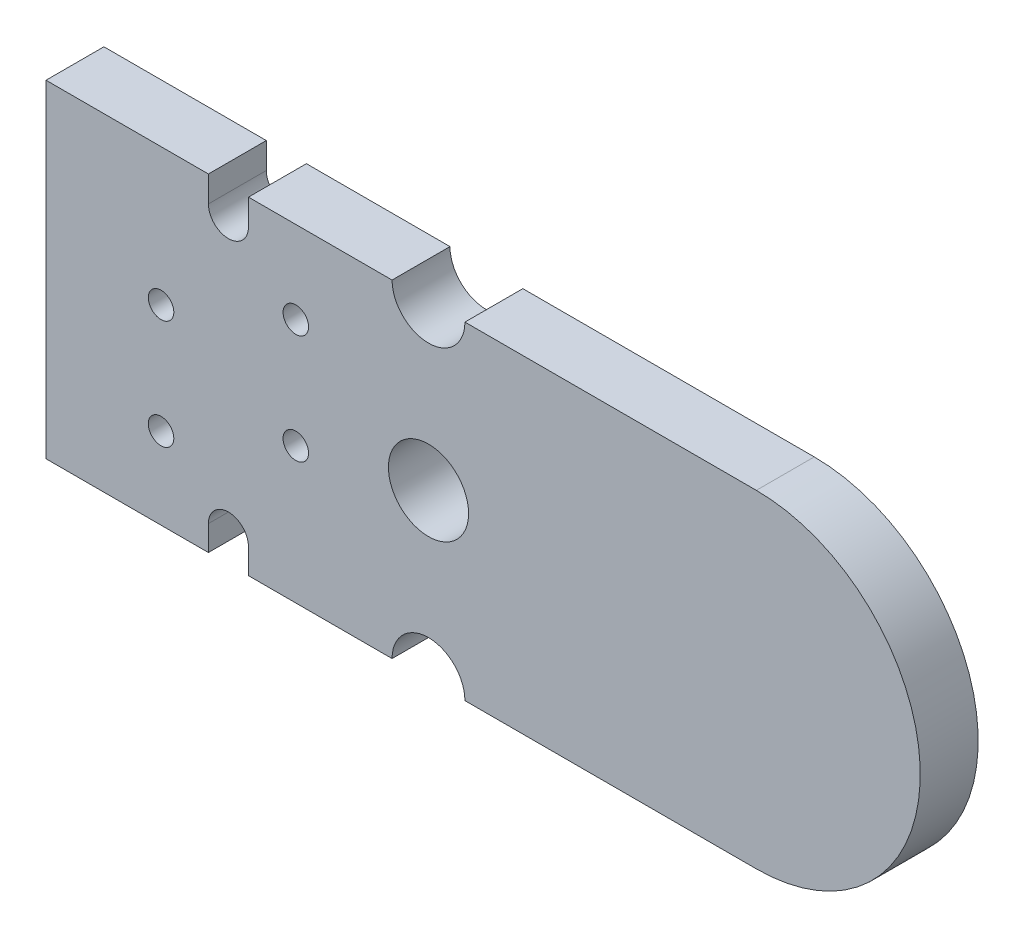
ISO-10303-21;
HEADER;
FILE_DESCRIPTION(('STEP AP214'),'2;1');
FILE_NAME('part.step','',(''),(''),'','','');
FILE_SCHEMA(('AUTOMOTIVE_DESIGN { 1 0 10303 214 1 1 1 1 }'));
ENDSEC;
DATA;
#1=APPLICATION_CONTEXT('core data for automotive mechanical design processes');
#2=APPLICATION_PROTOCOL_DEFINITION('international standard','automotive_design',2000,#1);
#3=PRODUCT_CONTEXT('',#1,'mechanical');
#4=PRODUCT('Part','Part','',(#3));
#5=PRODUCT_RELATED_PRODUCT_CATEGORY('part','',(#4));
#6=PRODUCT_DEFINITION_FORMATION('','',#4);
#7=PRODUCT_DEFINITION_CONTEXT('part definition',#1,'design');
#8=PRODUCT_DEFINITION('design','',#6,#7);
#9=PRODUCT_DEFINITION_SHAPE('','',#8);
#10=(LENGTH_UNIT() NAMED_UNIT(*) SI_UNIT(.MILLI.,.METRE.));
#11=(NAMED_UNIT(*) PLANE_ANGLE_UNIT() SI_UNIT($,.RADIAN.));
#12=(NAMED_UNIT(*) SI_UNIT($,.STERADIAN.) SOLID_ANGLE_UNIT());
#13=UNCERTAINTY_MEASURE_WITH_UNIT(LENGTH_MEASURE(1.E-05),#10,'distance_accuracy_value','');
#14=(GEOMETRIC_REPRESENTATION_CONTEXT(3) GLOBAL_UNCERTAINTY_ASSIGNED_CONTEXT((#13)) GLOBAL_UNIT_ASSIGNED_CONTEXT((#10,
#11,#12)) REPRESENTATION_CONTEXT('',''));
#15=CARTESIAN_POINT('',(0.,0.,0.));
#16=DIRECTION('',(0.,0.,1.));
#17=DIRECTION('',(1.,0.,0.));
#18=AXIS2_PLACEMENT_3D('',#15,#16,#17);
#19=CARTESIAN_POINT('',(28.00799,93.788,1.59));
#20=DIRECTION('',(0.,0.,-1.));
#21=DIRECTION('',(-1.,0.,0.));
#22=AXIS2_PLACEMENT_3D('',#19,#20,#21);
#23=CYLINDRICAL_SURFACE('',#22,0.550000000000002);
#24=CARTESIAN_POINT('',(28.00799,93.788,0.));
#25=DIRECTION('',(0.,0.,-1.));
#26=DIRECTION('',(-1.,0.,0.));
#27=AXIS2_PLACEMENT_3D('',#24,#25,#26);
#28=CIRCLE('',#27,0.550000000000002);
#29=CARTESIAN_POINT('',(28.55799,93.788,0.));
#30=VERTEX_POINT('',#29);
#31=CARTESIAN_POINT('',(27.45799,93.788,0.));
#32=VERTEX_POINT('',#31);
#33=EDGE_CURVE('E181',#30,#32,#28,.T.);
#34=ORIENTED_EDGE('',*,*,#33,.T.);
#35=DIRECTION('',(0.,0.,-1.));
#36=VECTOR('',#35,1.);
#37=CARTESIAN_POINT('',(27.45799,93.788,1.59));
#38=LINE('',#37,#36);
#39=CARTESIAN_POINT('',(27.45799,93.788,1.59));
#40=VERTEX_POINT('',#39);
#41=EDGE_CURVE('E11',#40,#32,#38,.T.);
#42=ORIENTED_EDGE('',*,*,#41,.F.);
#43=CARTESIAN_POINT('',(28.00799,93.788,1.59));
#44=DIRECTION('',(0.,0.,-1.));
#45=DIRECTION('',(-1.,0.,0.));
#46=AXIS2_PLACEMENT_3D('',#43,#44,#45);
#47=CIRCLE('',#46,0.550000000000002);
#48=CARTESIAN_POINT('',(28.55799,93.788,1.59));
#49=VERTEX_POINT('',#48);
#50=EDGE_CURVE('E212',#49,#40,#47,.T.);
#51=ORIENTED_EDGE('',*,*,#50,.F.);
#52=DIRECTION('',(0.,0.,-1.));
#53=VECTOR('',#52,1.);
#54=CARTESIAN_POINT('',(28.55799,93.788,1.59));
#55=LINE('',#54,#53);
#56=EDGE_CURVE('E177',#49,#30,#55,.T.);
#57=ORIENTED_EDGE('',*,*,#56,.T.);
#58=EDGE_LOOP('',(#34,#42,#51,#57));
#59=FACE_BOUND('',#58,.T.);
#60=ADVANCED_FACE('F37',(#59),#23,.F.);
#61=CARTESIAN_POINT('',(27.45799,93.788,1.59));
#62=DIRECTION('',(-1.,0.,0.));
#63=DIRECTION('',(0.,0.,1.));
#64=AXIS2_PLACEMENT_3D('',#61,#62,#63);
#65=PLANE('',#64);
#66=DIRECTION('',(0.,1.,0.));
#67=VECTOR('',#66,1.);
#68=CARTESIAN_POINT('',(27.45799,93.788,0.));
#69=LINE('',#68,#67);
#70=CARTESIAN_POINT('',(27.45799,94.5,0.));
#71=VERTEX_POINT('',#70);
#72=EDGE_CURVE('E184',#32,#71,#69,.T.);
#73=ORIENTED_EDGE('',*,*,#72,.T.);
#74=DIRECTION('',(0.,0.,-1.));
#75=VECTOR('',#74,1.);
#76=CARTESIAN_POINT('',(27.45799,94.5,1.59));
#77=LINE('',#76,#75);
#78=CARTESIAN_POINT('',(27.45799,94.5,1.59));
#79=VERTEX_POINT('',#78);
#80=EDGE_CURVE('E45',#79,#71,#77,.T.);
#81=ORIENTED_EDGE('',*,*,#80,.F.);
#82=DIRECTION('',(0.,1.,0.));
#83=VECTOR('',#82,1.);
#84=CARTESIAN_POINT('',(27.45799,93.788,1.59));
#85=LINE('',#84,#83);
#86=EDGE_CURVE('E120',#40,#79,#85,.T.);
#87=ORIENTED_EDGE('',*,*,#86,.F.);
#88=ORIENTED_EDGE('',*,*,#41,.T.);
#89=EDGE_LOOP('',(#73,#81,#87,#88));
#90=FACE_BOUND('',#89,.T.);
#91=ADVANCED_FACE('F312',(#90),#65,.F.);
#92=CARTESIAN_POINT('',(27.45799,94.5,1.59));
#93=DIRECTION('',(0.,-1.,0.));
#94=DIRECTION('',(0.,0.,-1.));
#95=AXIS2_PLACEMENT_3D('',#92,#93,#94);
#96=PLANE('',#95);
#97=DIRECTION('',(-1.,0.,0.));
#98=VECTOR('',#97,1.);
#99=CARTESIAN_POINT('',(27.45799,94.5,0.));
#100=LINE('',#99,#98);
#101=CARTESIAN_POINT('',(22.99997,94.5,0.));
#102=VERTEX_POINT('',#101);
#103=EDGE_CURVE('E187',#71,#102,#100,.T.);
#104=ORIENTED_EDGE('',*,*,#103,.T.);
#105=DIRECTION('',(0.,0.,-1.));
#106=VECTOR('',#105,1.);
#107=CARTESIAN_POINT('',(22.99997,94.5,1.59));
#108=LINE('',#107,#106);
#109=CARTESIAN_POINT('',(22.99997,94.5,1.59));
#110=VERTEX_POINT('',#109);
#111=EDGE_CURVE('E243',#110,#102,#108,.T.);
#112=ORIENTED_EDGE('',*,*,#111,.F.);
#113=DIRECTION('',(-1.,0.,0.));
#114=VECTOR('',#113,1.);
#115=CARTESIAN_POINT('',(27.45799,94.5,1.59));
#116=LINE('',#115,#114);
#117=EDGE_CURVE('E251',#79,#110,#116,.T.);
#118=ORIENTED_EDGE('',*,*,#117,.F.);
#119=ORIENTED_EDGE('',*,*,#80,.T.);
#120=EDGE_LOOP('',(#104,#112,#118,#119));
#121=FACE_BOUND('',#120,.T.);
#122=ADVANCED_FACE('F249',(#121),#96,.F.);
#123=CARTESIAN_POINT('',(22.99997,94.5,1.59));
#124=DIRECTION('',(1.,0.,0.));
#125=DIRECTION('',(0.,0.,-1.));
#126=AXIS2_PLACEMENT_3D('',#123,#124,#125);
#127=PLANE('',#126);
#128=DIRECTION('',(0.,-1.,0.));
#129=VECTOR('',#128,1.);
#130=CARTESIAN_POINT('',(22.99997,94.5,0.));
#131=LINE('',#130,#129);
#132=CARTESIAN_POINT('',(22.99997,85.5,0.));
#133=VERTEX_POINT('',#132);
#134=EDGE_CURVE('E189',#102,#133,#131,.T.);
#135=ORIENTED_EDGE('',*,*,#134,.T.);
#136=DIRECTION('',(0.,0.,-1.));
#137=VECTOR('',#136,1.);
#138=CARTESIAN_POINT('',(22.99997,85.5,1.59));
#139=LINE('',#138,#137);
#140=CARTESIAN_POINT('',(22.99997,85.5,1.59));
#141=VERTEX_POINT('',#140);
#142=EDGE_CURVE('E240',#141,#133,#139,.T.);
#143=ORIENTED_EDGE('',*,*,#142,.F.);
#144=DIRECTION('',(0.,-1.,0.));
#145=VECTOR('',#144,1.);
#146=CARTESIAN_POINT('',(22.99997,94.5,1.59));
#147=LINE('',#146,#145);
#148=EDGE_CURVE('E269',#110,#141,#147,.T.);
#149=ORIENTED_EDGE('',*,*,#148,.F.);
#150=ORIENTED_EDGE('',*,*,#111,.T.);
#151=EDGE_LOOP('',(#135,#143,#149,#150));
#152=FACE_BOUND('',#151,.T.);
#153=ADVANCED_FACE('F260',(#152),#127,.F.);
#154=CARTESIAN_POINT('',(22.99997,85.5,1.59));
#155=DIRECTION('',(4.48629661083333E-06,0.999999999989937,0.));
#156=DIRECTION('',(-0.999999999989937,4.48629661083333E-06,0.));
#157=AXIS2_PLACEMENT_3D('',#154,#155,#156);
#158=PLANE('',#157);
#159=DIRECTION('',(0.999999999989937,-4.48629661083333E-06,0.));
#160=VECTOR('',#159,1.);
#161=CARTESIAN_POINT('',(22.99997,85.5,0.));
#162=LINE('',#161,#160);
#163=CARTESIAN_POINT('',(27.45799,85.49998,0.));
#164=VERTEX_POINT('',#163);
#165=EDGE_CURVE('E191',#133,#164,#162,.T.);
#166=ORIENTED_EDGE('',*,*,#165,.T.);
#167=DIRECTION('',(0.,0.,-1.));
#168=VECTOR('',#167,1.);
#169=CARTESIAN_POINT('',(27.45799,85.49998,1.59));
#170=LINE('',#169,#168);
#171=CARTESIAN_POINT('',(27.45799,85.49998,1.59));
#172=VERTEX_POINT('',#171);
#173=EDGE_CURVE('E237',#172,#164,#170,.T.);
#174=ORIENTED_EDGE('',*,*,#173,.F.);
#175=DIRECTION('',(0.999999999989937,-4.48629661083333E-06,0.));
#176=VECTOR('',#175,1.);
#177=CARTESIAN_POINT('',(22.99997,85.5,1.59));
#178=LINE('',#177,#176);
#179=EDGE_CURVE('E266',#141,#172,#178,.T.);
#180=ORIENTED_EDGE('',*,*,#179,.F.);
#181=ORIENTED_EDGE('',*,*,#142,.T.);
#182=EDGE_LOOP('',(#166,#174,#180,#181));
#183=FACE_BOUND('',#182,.T.);
#184=ADVANCED_FACE('F264',(#183),#158,.F.);
#185=CARTESIAN_POINT('',(27.45799,85.49998,1.59));
#186=DIRECTION('',(-1.,0.,0.));
#187=DIRECTION('',(0.,0.,1.));
#188=AXIS2_PLACEMENT_3D('',#185,#186,#187);
#189=PLANE('',#188);
#190=DIRECTION('',(0.,1.,0.));
#191=VECTOR('',#190,1.);
#192=CARTESIAN_POINT('',(27.45799,85.49998,0.));
#193=LINE('',#192,#191);
#194=CARTESIAN_POINT('',(27.45799,86.18801,0.));
#195=VERTEX_POINT('',#194);
#196=EDGE_CURVE('E193',#164,#195,#193,.T.);
#197=ORIENTED_EDGE('',*,*,#196,.T.);
#198=DIRECTION('',(0.,0.,-1.));
#199=VECTOR('',#198,1.);
#200=CARTESIAN_POINT('',(27.45799,86.18801,1.59));
#201=LINE('',#200,#199);
#202=CARTESIAN_POINT('',(27.45799,86.18801,1.59));
#203=VERTEX_POINT('',#202);
#204=EDGE_CURVE('E234',#203,#195,#201,.T.);
#205=ORIENTED_EDGE('',*,*,#204,.F.);
#206=DIRECTION('',(0.,1.,0.));
#207=VECTOR('',#206,1.);
#208=CARTESIAN_POINT('',(27.45799,85.49998,1.59));
#209=LINE('',#208,#207);
#210=EDGE_CURVE('E268',#172,#203,#209,.T.);
#211=ORIENTED_EDGE('',*,*,#210,.F.);
#212=ORIENTED_EDGE('',*,*,#173,.T.);
#213=EDGE_LOOP('',(#197,#205,#211,#212));
#214=FACE_BOUND('',#213,.T.);
#215=ADVANCED_FACE('F325',(#214),#189,.F.);
#216=CARTESIAN_POINT('',(28.00799,86.18801,1.59));
#217=DIRECTION('',(0.,0.,-1.));
#218=DIRECTION('',(-1.,0.,0.));
#219=AXIS2_PLACEMENT_3D('',#216,#217,#218);
#220=CYLINDRICAL_SURFACE('',#219,0.550000000000002);
#221=CARTESIAN_POINT('',(28.00799,86.18801,0.));
#222=DIRECTION('',(0.,0.,-1.));
#223=DIRECTION('',(-1.,0.,0.));
#224=AXIS2_PLACEMENT_3D('',#221,#222,#223);
#225=CIRCLE('',#224,0.550000000000002);
#226=CARTESIAN_POINT('',(28.55799,86.18801,0.));
#227=VERTEX_POINT('',#226);
#228=EDGE_CURVE('E195',#195,#227,#225,.T.);
#229=ORIENTED_EDGE('',*,*,#228,.T.);
#230=DIRECTION('',(0.,0.,-1.));
#231=VECTOR('',#230,1.);
#232=CARTESIAN_POINT('',(28.55799,86.18801,1.59));
#233=LINE('',#232,#231);
#234=CARTESIAN_POINT('',(28.55799,86.18801,1.59));
#235=VERTEX_POINT('',#234);
#236=EDGE_CURVE('E231',#235,#227,#233,.T.);
#237=ORIENTED_EDGE('',*,*,#236,.F.);
#238=CARTESIAN_POINT('',(28.00799,86.18801,1.59));
#239=DIRECTION('',(0.,0.,-1.));
#240=DIRECTION('',(-1.,0.,0.));
#241=AXIS2_PLACEMENT_3D('',#238,#239,#240);
#242=CIRCLE('',#241,0.550000000000002);
#243=EDGE_CURVE('E271',#203,#235,#242,.T.);
#244=ORIENTED_EDGE('',*,*,#243,.F.);
#245=ORIENTED_EDGE('',*,*,#204,.T.);
#246=EDGE_LOOP('',(#229,#237,#244,#245));
#247=FACE_BOUND('',#246,.T.);
#248=ADVANCED_FACE('F328',(#247),#220,.F.);
#249=CARTESIAN_POINT('',(28.55799,86.18801,1.59));
#250=DIRECTION('',(1.,0.,0.));
#251=DIRECTION('',(0.,0.,-1.));
#252=AXIS2_PLACEMENT_3D('',#249,#250,#251);
#253=PLANE('',#252);
#254=DIRECTION('',(0.,-1.,0.));
#255=VECTOR('',#254,1.);
#256=CARTESIAN_POINT('',(28.55799,86.18801,0.));
#257=LINE('',#256,#255);
#258=CARTESIAN_POINT('',(28.55799,85.49998,0.));
#259=VERTEX_POINT('',#258);
#260=EDGE_CURVE('E197',#227,#259,#257,.T.);
#261=ORIENTED_EDGE('',*,*,#260,.T.);
#262=DIRECTION('',(0.,0.,-1.));
#263=VECTOR('',#262,1.);
#264=CARTESIAN_POINT('',(28.55799,85.49998,1.59));
#265=LINE('',#264,#263);
#266=CARTESIAN_POINT('',(28.55799,85.49998,1.59));
#267=VERTEX_POINT('',#266);
#268=EDGE_CURVE('E228',#267,#259,#265,.T.);
#269=ORIENTED_EDGE('',*,*,#268,.F.);
#270=DIRECTION('',(0.,-1.,0.));
#271=VECTOR('',#270,1.);
#272=CARTESIAN_POINT('',(28.55799,86.18801,1.59));
#273=LINE('',#272,#271);
#274=EDGE_CURVE('E277',#235,#267,#273,.T.);
#275=ORIENTED_EDGE('',*,*,#274,.F.);
#276=ORIENTED_EDGE('',*,*,#236,.T.);
#277=EDGE_LOOP('',(#261,#269,#275,#276));
#278=FACE_BOUND('',#277,.T.);
#279=ADVANCED_FACE('F332',(#278),#253,.F.);
#280=CARTESIAN_POINT('',(28.55799,85.49998,1.59));
#281=DIRECTION('',(0.,1.,0.));
#282=DIRECTION('',(0.,0.,1.));
#283=AXIS2_PLACEMENT_3D('',#280,#281,#282);
#284=PLANE('',#283);
#285=DIRECTION('',(1.,0.,0.));
#286=VECTOR('',#285,1.);
#287=CARTESIAN_POINT('',(28.55799,85.49998,0.));
#288=LINE('',#287,#286);
#289=CARTESIAN_POINT('',(32.49999,85.49998,0.));
#290=VERTEX_POINT('',#289);
#291=EDGE_CURVE('E199',#259,#290,#288,.T.);
#292=ORIENTED_EDGE('',*,*,#291,.T.);
#293=DIRECTION('',(0.,0.,-1.));
#294=VECTOR('',#293,1.);
#295=CARTESIAN_POINT('',(32.49999,85.49998,1.59));
#296=LINE('',#295,#294);
#297=CARTESIAN_POINT('',(32.49999,85.49998,1.59));
#298=VERTEX_POINT('',#297);
#299=EDGE_CURVE('E225',#298,#290,#296,.T.);
#300=ORIENTED_EDGE('',*,*,#299,.F.);
#301=DIRECTION('',(1.,0.,0.));
#302=VECTOR('',#301,1.);
#303=CARTESIAN_POINT('',(28.55799,85.49998,1.59));
#304=LINE('',#303,#302);
#305=EDGE_CURVE('E279',#267,#298,#304,.T.);
#306=ORIENTED_EDGE('',*,*,#305,.F.);
#307=ORIENTED_EDGE('',*,*,#268,.T.);
#308=EDGE_LOOP('',(#292,#300,#306,#307));
#309=FACE_BOUND('',#308,.T.);
#310=ADVANCED_FACE('F336',(#309),#284,.F.);
#311=CARTESIAN_POINT('',(33.49998,85.49999,1.59));
#312=DIRECTION('',(0.,0.,-1.));
#313=DIRECTION('',(-1.,0.,0.));
#314=AXIS2_PLACEMENT_3D('',#311,#312,#313);
#315=CYLINDRICAL_SURFACE('',#314,0.99999000005);
#316=CARTESIAN_POINT('',(33.49998,85.49999,0.));
#317=DIRECTION('',(0.,0.,-1.));
#318=DIRECTION('',(-1.,0.,0.));
#319=AXIS2_PLACEMENT_3D('',#316,#317,#318);
#320=CIRCLE('',#319,0.99999000005);
#321=CARTESIAN_POINT('',(34.49997,85.5,0.));
#322=VERTEX_POINT('',#321);
#323=EDGE_CURVE('E201',#290,#322,#320,.T.);
#324=ORIENTED_EDGE('',*,*,#323,.T.);
#325=DIRECTION('',(0.,0.,-1.));
#326=VECTOR('',#325,1.);
#327=CARTESIAN_POINT('',(34.49997,85.5,1.59));
#328=LINE('',#327,#326);
#329=CARTESIAN_POINT('',(34.49997,85.5,1.59));
#330=VERTEX_POINT('',#329);
#331=EDGE_CURVE('E222',#330,#322,#328,.T.);
#332=ORIENTED_EDGE('',*,*,#331,.F.);
#333=CARTESIAN_POINT('',(33.49998,85.49999,1.59));
#334=DIRECTION('',(0.,0.,-1.));
#335=DIRECTION('',(-1.,0.,0.));
#336=AXIS2_PLACEMENT_3D('',#333,#334,#335);
#337=CIRCLE('',#336,0.99999000005);
#338=EDGE_CURVE('E281',#298,#330,#337,.T.);
#339=ORIENTED_EDGE('',*,*,#338,.F.);
#340=ORIENTED_EDGE('',*,*,#299,.T.);
#341=EDGE_LOOP('',(#324,#332,#339,#340));
#342=FACE_BOUND('',#341,.T.);
#343=ADVANCED_FACE('F340',(#342),#315,.F.);
#344=CARTESIAN_POINT('',(34.49997,85.5,1.59));
#345=DIRECTION('',(0.,1.,0.));
#346=DIRECTION('',(0.,0.,1.));
#347=AXIS2_PLACEMENT_3D('',#344,#345,#346);
#348=PLANE('',#347);
#349=DIRECTION('',(1.,0.,0.));
#350=VECTOR('',#349,1.);
#351=CARTESIAN_POINT('',(34.49997,85.5,0.));
#352=LINE('',#351,#350);
#353=CARTESIAN_POINT('',(42.49997,85.5,0.));
#354=VERTEX_POINT('',#353);
#355=EDGE_CURVE('E203',#322,#354,#352,.T.);
#356=ORIENTED_EDGE('',*,*,#355,.T.);
#357=DIRECTION('',(0.,0.,-1.));
#358=VECTOR('',#357,1.);
#359=CARTESIAN_POINT('',(42.49997,85.5,1.59));
#360=LINE('',#359,#358);
#361=CARTESIAN_POINT('',(42.49997,85.5,1.59));
#362=VERTEX_POINT('',#361);
#363=EDGE_CURVE('E219',#362,#354,#360,.T.);
#364=ORIENTED_EDGE('',*,*,#363,.F.);
#365=DIRECTION('',(1.,0.,0.));
#366=VECTOR('',#365,1.);
#367=CARTESIAN_POINT('',(34.49997,85.5,1.59));
#368=LINE('',#367,#366);
#369=EDGE_CURVE('E283',#330,#362,#368,.T.);
#370=ORIENTED_EDGE('',*,*,#369,.F.);
#371=ORIENTED_EDGE('',*,*,#331,.T.);
#372=EDGE_LOOP('',(#356,#364,#370,#371));
#373=FACE_BOUND('',#372,.T.);
#374=ADVANCED_FACE('F344',(#373),#348,.F.);
#375=CARTESIAN_POINT('',(42.4999701774114,90.,1.59));
#376=DIRECTION('',(0.,0.,-1.));
#377=DIRECTION('',(-1.,0.,0.));
#378=AXIS2_PLACEMENT_3D('',#375,#376,#377);
#379=CYLINDRICAL_SURFACE('',#378,4.5);
#380=CARTESIAN_POINT('',(42.4999701774114,90.,0.));
#381=DIRECTION('',(0.,0.,1.));
#382=DIRECTION('',(1.,0.,0.));
#383=AXIS2_PLACEMENT_3D('',#380,#381,#382);
#384=CIRCLE('',#383,4.5);
#385=CARTESIAN_POINT('',(42.49997,94.5,0.));
#386=VERTEX_POINT('',#385);
#387=EDGE_CURVE('E205',#354,#386,#384,.T.);
#388=ORIENTED_EDGE('',*,*,#387,.T.);
#389=DIRECTION('',(0.,0.,-1.));
#390=VECTOR('',#389,1.);
#391=CARTESIAN_POINT('',(42.49997,94.5,1.59));
#392=LINE('',#391,#390);
#393=CARTESIAN_POINT('',(42.49997,94.5,1.59));
#394=VERTEX_POINT('',#393);
#395=EDGE_CURVE('E216',#394,#386,#392,.T.);
#396=ORIENTED_EDGE('',*,*,#395,.F.);
#397=CARTESIAN_POINT('',(42.4999701774114,90.,1.59));
#398=DIRECTION('',(0.,0.,1.));
#399=DIRECTION('',(1.,0.,0.));
#400=AXIS2_PLACEMENT_3D('',#397,#398,#399);
#401=CIRCLE('',#400,4.5);
#402=EDGE_CURVE('E285',#362,#394,#401,.T.);
#403=ORIENTED_EDGE('',*,*,#402,.F.);
#404=ORIENTED_EDGE('',*,*,#363,.T.);
#405=EDGE_LOOP('',(#388,#396,#403,#404));
#406=FACE_BOUND('',#405,.T.);
#407=ADVANCED_FACE('F291',(#406),#379,.T.);
#408=CARTESIAN_POINT('',(42.49997,94.5,1.59));
#409=DIRECTION('',(0.,-1.,0.));
#410=DIRECTION('',(0.,0.,-1.));
#411=AXIS2_PLACEMENT_3D('',#408,#409,#410);
#412=PLANE('',#411);
#413=DIRECTION('',(-1.,0.,0.));
#414=VECTOR('',#413,1.);
#415=CARTESIAN_POINT('',(42.49997,94.5,0.));
#416=LINE('',#415,#414);
#417=CARTESIAN_POINT('',(34.49997,94.5,0.));
#418=VERTEX_POINT('',#417);
#419=EDGE_CURVE('E207',#386,#418,#416,.T.);
#420=ORIENTED_EDGE('',*,*,#419,.T.);
#421=DIRECTION('',(0.,0.,-1.));
#422=VECTOR('',#421,1.);
#423=CARTESIAN_POINT('',(34.49997,94.5,1.59));
#424=LINE('',#423,#422);
#425=CARTESIAN_POINT('',(34.49997,94.5,1.59));
#426=VERTEX_POINT('',#425);
#427=EDGE_CURVE('E172',#426,#418,#424,.T.);
#428=ORIENTED_EDGE('',*,*,#427,.F.);
#429=DIRECTION('',(-1.,0.,0.));
#430=VECTOR('',#429,1.);
#431=CARTESIAN_POINT('',(42.49997,94.5,1.59));
#432=LINE('',#431,#430);
#433=EDGE_CURVE('E163',#394,#426,#432,.T.);
#434=ORIENTED_EDGE('',*,*,#433,.F.);
#435=ORIENTED_EDGE('',*,*,#395,.T.);
#436=EDGE_LOOP('',(#420,#428,#434,#435));
#437=FACE_BOUND('',#436,.T.);
#438=ADVANCED_FACE('F295',(#437),#412,.F.);
#439=CARTESIAN_POINT('',(33.49997,94.5,1.59));
#440=DIRECTION('',(0.,0.,-1.));
#441=DIRECTION('',(-1.,0.,0.));
#442=AXIS2_PLACEMENT_3D('',#439,#440,#441);
#443=CYLINDRICAL_SURFACE('',#442,1.);
#444=CARTESIAN_POINT('',(33.49997,94.5,0.));
#445=DIRECTION('',(0.,0.,-1.));
#446=DIRECTION('',(-1.,0.,0.));
#447=AXIS2_PLACEMENT_3D('',#444,#445,#446);
#448=CIRCLE('',#447,1.);
#449=CARTESIAN_POINT('',(32.49997,94.5,0.));
#450=VERTEX_POINT('',#449);
#451=EDGE_CURVE('E171',#418,#450,#448,.T.);
#452=ORIENTED_EDGE('',*,*,#451,.T.);
#453=DIRECTION('',(0.,0.,-1.));
#454=VECTOR('',#453,1.);
#455=CARTESIAN_POINT('',(32.49997,94.5,1.59));
#456=LINE('',#455,#454);
#457=CARTESIAN_POINT('',(32.49997,94.5,1.59));
#458=VERTEX_POINT('',#457);
#459=EDGE_CURVE('E168',#458,#450,#456,.T.);
#460=ORIENTED_EDGE('',*,*,#459,.F.);
#461=CARTESIAN_POINT('',(33.49997,94.5,1.59));
#462=DIRECTION('',(0.,0.,-1.));
#463=DIRECTION('',(-1.,0.,0.));
#464=AXIS2_PLACEMENT_3D('',#461,#462,#463);
#465=CIRCLE('',#464,1.);
#466=EDGE_CURVE('E157',#426,#458,#465,.T.);
#467=ORIENTED_EDGE('',*,*,#466,.F.);
#468=ORIENTED_EDGE('',*,*,#427,.T.);
#469=EDGE_LOOP('',(#452,#460,#467,#468));
#470=FACE_BOUND('',#469,.T.);
#471=ADVANCED_FACE('F169',(#470),#443,.F.);
#472=CARTESIAN_POINT('',(32.49997,94.5,1.59));
#473=DIRECTION('',(0.,-1.,0.));
#474=DIRECTION('',(0.,0.,-1.));
#475=AXIS2_PLACEMENT_3D('',#472,#473,#474);
#476=PLANE('',#475);
#477=DIRECTION('',(-1.,0.,0.));
#478=VECTOR('',#477,1.);
#479=CARTESIAN_POINT('',(32.49997,94.5,0.));
#480=LINE('',#479,#478);
#481=CARTESIAN_POINT('',(28.55799,94.5,0.));
#482=VERTEX_POINT('',#481);
#483=EDGE_CURVE('E106',#450,#482,#480,.T.);
#484=ORIENTED_EDGE('',*,*,#483,.T.);
#485=DIRECTION('',(0.,0.,-1.));
#486=VECTOR('',#485,1.);
#487=CARTESIAN_POINT('',(28.55799,94.5,1.59));
#488=LINE('',#487,#486);
#489=CARTESIAN_POINT('',(28.55799,94.5,1.59));
#490=VERTEX_POINT('',#489);
#491=EDGE_CURVE('E173',#490,#482,#488,.T.);
#492=ORIENTED_EDGE('',*,*,#491,.F.);
#493=DIRECTION('',(-1.,0.,0.));
#494=VECTOR('',#493,1.);
#495=CARTESIAN_POINT('',(32.49997,94.5,1.59));
#496=LINE('',#495,#494);
#497=EDGE_CURVE('E161',#458,#490,#496,.T.);
#498=ORIENTED_EDGE('',*,*,#497,.F.);
#499=ORIENTED_EDGE('',*,*,#459,.T.);
#500=EDGE_LOOP('',(#484,#492,#498,#499));
#501=FACE_BOUND('',#500,.T.);
#502=ADVANCED_FACE('F175',(#501),#476,.F.);
#503=CARTESIAN_POINT('',(28.55799,94.5,1.59));
#504=DIRECTION('',(1.,0.,0.));
#505=DIRECTION('',(0.,0.,-1.));
#506=AXIS2_PLACEMENT_3D('',#503,#504,#505);
#507=PLANE('',#506);
#508=DIRECTION('',(0.,-1.,0.));
#509=VECTOR('',#508,1.);
#510=CARTESIAN_POINT('',(28.55799,94.5,0.));
#511=LINE('',#510,#509);
#512=EDGE_CURVE('E112',#482,#30,#511,.T.);
#513=ORIENTED_EDGE('',*,*,#512,.T.);
#514=ORIENTED_EDGE('',*,*,#56,.F.);
#515=DIRECTION('',(0.,-1.,0.));
#516=VECTOR('',#515,1.);
#517=CARTESIAN_POINT('',(28.55799,94.5,1.59));
#518=LINE('',#517,#516);
#519=EDGE_CURVE('E53',#490,#49,#518,.T.);
#520=ORIENTED_EDGE('',*,*,#519,.F.);
#521=ORIENTED_EDGE('',*,*,#491,.T.);
#522=EDGE_LOOP('',(#513,#514,#520,#521));
#523=FACE_BOUND('',#522,.T.);
#524=ADVANCED_FACE('F299',(#523),#507,.F.);
#525=CARTESIAN_POINT('',(28.00799,93.788,1.59));
#526=DIRECTION('',(0.,0.,-1.));
#527=DIRECTION('',(-1.,0.,0.));
#528=AXIS2_PLACEMENT_3D('',#525,#526,#527);
#529=PLANE('',#528);
#530=CARTESIAN_POINT('',(33.49997,90.,1.59));
#531=DIRECTION('',(0.,0.,1.));
#532=DIRECTION('',(1.,0.,0.));
#533=AXIS2_PLACEMENT_3D('',#530,#531,#532);
#534=CIRCLE('',#533,1.1);
#535=CARTESIAN_POINT('',(34.59997,90.,1.59));
#536=VERTEX_POINT('',#535);
#537=EDGE_CURVE('E437',#536,#536,#534,.T.);
#538=ORIENTED_EDGE('',*,*,#537,.F.);
#539=EDGE_LOOP('',(#538));
#540=FACE_BOUND('',#539,.T.);
#541=CARTESIAN_POINT('',(26.15799,87.738,1.58999999999999));
#542=DIRECTION('',(0.,0.,-1.));
#543=DIRECTION('',(-1.,0.,0.));
#544=AXIS2_PLACEMENT_3D('',#541,#542,#543);
#545=CIRCLE('',#544,0.349999999999986);
#546=CARTESIAN_POINT('',(25.80799,87.738,1.58999999999999));
#547=VERTEX_POINT('',#546);
#548=EDGE_CURVE('E444',#547,#547,#545,.T.);
#549=ORIENTED_EDGE('',*,*,#548,.T.);
#550=EDGE_LOOP('',(#549));
#551=FACE_BOUND('',#550,.T.);
#552=CARTESIAN_POINT('',(29.85799,89.238,1.58999999999999));
#553=DIRECTION('',(0.,0.,-1.));
#554=DIRECTION('',(-1.,0.,0.));
#555=AXIS2_PLACEMENT_3D('',#552,#553,#554);
#556=CIRCLE('',#555,0.349999999999986);
#557=CARTESIAN_POINT('',(29.50799,89.238,1.58999999999999));
#558=VERTEX_POINT('',#557);
#559=EDGE_CURVE('E450',#558,#558,#556,.T.);
#560=ORIENTED_EDGE('',*,*,#559,.T.);
#561=EDGE_LOOP('',(#560));
#562=FACE_BOUND('',#561,.T.);
#563=CARTESIAN_POINT('',(26.15799,90.738,1.58999999999999));
#564=DIRECTION('',(0.,0.,-1.));
#565=DIRECTION('',(-1.,0.,0.));
#566=AXIS2_PLACEMENT_3D('',#563,#564,#565);
#567=CIRCLE('',#566,0.349999999999986);
#568=CARTESIAN_POINT('',(25.80799,90.738,1.58999999999999));
#569=VERTEX_POINT('',#568);
#570=EDGE_CURVE('E456',#569,#569,#567,.T.);
#571=ORIENTED_EDGE('',*,*,#570,.T.);
#572=EDGE_LOOP('',(#571));
#573=FACE_BOUND('',#572,.T.);
#574=CARTESIAN_POINT('',(29.85799,92.238,1.58999999999999));
#575=DIRECTION('',(0.,0.,-1.));
#576=DIRECTION('',(-1.,0.,0.));
#577=AXIS2_PLACEMENT_3D('',#574,#575,#576);
#578=CIRCLE('',#577,0.349999999999986);
#579=CARTESIAN_POINT('',(29.50799,92.238,1.58999999999999));
#580=VERTEX_POINT('',#579);
#581=EDGE_CURVE('E185',#580,#580,#578,.T.);
#582=ORIENTED_EDGE('',*,*,#581,.T.);
#583=EDGE_LOOP('',(#582));
#584=FACE_BOUND('',#583,.T.);
#585=ORIENTED_EDGE('',*,*,#50,.T.);
#586=ORIENTED_EDGE('',*,*,#86,.T.);
#587=ORIENTED_EDGE('',*,*,#117,.T.);
#588=ORIENTED_EDGE('',*,*,#148,.T.);
#589=ORIENTED_EDGE('',*,*,#179,.T.);
#590=ORIENTED_EDGE('',*,*,#210,.T.);
#591=ORIENTED_EDGE('',*,*,#243,.T.);
#592=ORIENTED_EDGE('',*,*,#274,.T.);
#593=ORIENTED_EDGE('',*,*,#305,.T.);
#594=ORIENTED_EDGE('',*,*,#338,.T.);
#595=ORIENTED_EDGE('',*,*,#369,.T.);
#596=ORIENTED_EDGE('',*,*,#402,.T.);
#597=ORIENTED_EDGE('',*,*,#433,.T.);
#598=ORIENTED_EDGE('',*,*,#466,.T.);
#599=ORIENTED_EDGE('',*,*,#497,.T.);
#600=ORIENTED_EDGE('',*,*,#519,.T.);
#601=EDGE_LOOP('',(#585,#586,#587,#588,#589,#590,#591,#592,#593,#594,#595,#596,#597,#598,#599,#600));
#602=FACE_BOUND('',#601,.T.);
#603=ADVANCED_FACE('F159',(#540,#551,#562,#573,#584,#602),#529,.F.);
#604=CARTESIAN_POINT('',(28.00799,93.788,0.));
#605=DIRECTION('',(0.,0.,-1.));
#606=DIRECTION('',(-1.,0.,0.));
#607=AXIS2_PLACEMENT_3D('',#604,#605,#606);
#608=PLANE('',#607);
#609=CARTESIAN_POINT('',(33.49997,90.,0.));
#610=DIRECTION('',(0.,0.,1.));
#611=DIRECTION('',(1.,0.,0.));
#612=AXIS2_PLACEMENT_3D('',#609,#610,#611);
#613=CIRCLE('',#612,1.1);
#614=CARTESIAN_POINT('',(34.59997,90.,0.));
#615=VERTEX_POINT('',#614);
#616=EDGE_CURVE('E434',#615,#615,#613,.T.);
#617=ORIENTED_EDGE('',*,*,#616,.T.);
#618=EDGE_LOOP('',(#617));
#619=FACE_BOUND('',#618,.T.);
#620=CARTESIAN_POINT('',(26.15799,87.738,0.));
#621=DIRECTION('',(0.,0.,-1.));
#622=DIRECTION('',(-1.,0.,0.));
#623=AXIS2_PLACEMENT_3D('',#620,#621,#622);
#624=CIRCLE('',#623,0.349999999999986);
#625=CARTESIAN_POINT('',(25.80799,87.738,0.));
#626=VERTEX_POINT('',#625);
#627=EDGE_CURVE('E439',#626,#626,#624,.T.);
#628=ORIENTED_EDGE('',*,*,#627,.F.);
#629=EDGE_LOOP('',(#628));
#630=FACE_BOUND('',#629,.T.);
#631=CARTESIAN_POINT('',(29.85799,89.238,0.));
#632=DIRECTION('',(0.,0.,-1.));
#633=DIRECTION('',(-1.,0.,0.));
#634=AXIS2_PLACEMENT_3D('',#631,#632,#633);
#635=CIRCLE('',#634,0.349999999999989);
#636=CARTESIAN_POINT('',(29.50799,89.238,0.));
#637=VERTEX_POINT('',#636);
#638=EDGE_CURVE('E447',#637,#637,#635,.T.);
#639=ORIENTED_EDGE('',*,*,#638,.F.);
#640=EDGE_LOOP('',(#639));
#641=FACE_BOUND('',#640,.T.);
#642=CARTESIAN_POINT('',(26.15799,90.738,0.));
#643=DIRECTION('',(0.,0.,-1.));
#644=DIRECTION('',(-1.,0.,0.));
#645=AXIS2_PLACEMENT_3D('',#642,#643,#644);
#646=CIRCLE('',#645,0.349999999999986);
#647=CARTESIAN_POINT('',(25.80799,90.738,0.));
#648=VERTEX_POINT('',#647);
#649=EDGE_CURVE('E453',#648,#648,#646,.T.);
#650=ORIENTED_EDGE('',*,*,#649,.F.);
#651=EDGE_LOOP('',(#650));
#652=FACE_BOUND('',#651,.T.);
#653=CARTESIAN_POINT('',(29.85799,92.238,0.));
#654=DIRECTION('',(0.,0.,-1.));
#655=DIRECTION('',(-1.,0.,0.));
#656=AXIS2_PLACEMENT_3D('',#653,#654,#655);
#657=CIRCLE('',#656,0.349999999999989);
#658=CARTESIAN_POINT('',(29.50799,92.238,0.));
#659=VERTEX_POINT('',#658);
#660=EDGE_CURVE('E459',#659,#659,#657,.T.);
#661=ORIENTED_EDGE('',*,*,#660,.F.);
#662=EDGE_LOOP('',(#661));
#663=FACE_BOUND('',#662,.T.);
#664=ORIENTED_EDGE('',*,*,#33,.F.);
#665=ORIENTED_EDGE('',*,*,#512,.F.);
#666=ORIENTED_EDGE('',*,*,#483,.F.);
#667=ORIENTED_EDGE('',*,*,#451,.F.);
#668=ORIENTED_EDGE('',*,*,#419,.F.);
#669=ORIENTED_EDGE('',*,*,#387,.F.);
#670=ORIENTED_EDGE('',*,*,#355,.F.);
#671=ORIENTED_EDGE('',*,*,#323,.F.);
#672=ORIENTED_EDGE('',*,*,#291,.F.);
#673=ORIENTED_EDGE('',*,*,#260,.F.);
#674=ORIENTED_EDGE('',*,*,#228,.F.);
#675=ORIENTED_EDGE('',*,*,#196,.F.);
#676=ORIENTED_EDGE('',*,*,#165,.F.);
#677=ORIENTED_EDGE('',*,*,#134,.F.);
#678=ORIENTED_EDGE('',*,*,#103,.F.);
#679=ORIENTED_EDGE('',*,*,#72,.F.);
#680=EDGE_LOOP('',(#664,#665,#666,#667,#668,#669,#670,#671,#672,#673,#674,#675,#676,#677,#678,#679));
#681=FACE_BOUND('',#680,.T.);
#682=ADVANCED_FACE('F255',(#619,#630,#641,#652,#663,#681),#608,.T.);
#683=CARTESIAN_POINT('',(29.85799,92.238,0.));
#684=DIRECTION('',(0.,0.,-1.));
#685=DIRECTION('',(-1.,0.,0.));
#686=AXIS2_PLACEMENT_3D('',#683,#684,#685);
#687=CYLINDRICAL_SURFACE('',#686,0.349999999999987);
#688=ORIENTED_EDGE('',*,*,#581,.F.);
#689=EDGE_LOOP('',(#688));
#690=FACE_BOUND('',#689,.T.);
#691=ORIENTED_EDGE('',*,*,#660,.T.);
#692=EDGE_LOOP('',(#691));
#693=FACE_BOUND('',#692,.T.);
#694=ADVANCED_FACE('F372',(#690,#693),#687,.F.);
#695=CARTESIAN_POINT('',(26.15799,90.738,0.));
#696=DIRECTION('',(0.,0.,-1.));
#697=DIRECTION('',(-1.,0.,0.));
#698=AXIS2_PLACEMENT_3D('',#695,#696,#697);
#699=CYLINDRICAL_SURFACE('',#698,0.349999999999986);
#700=ORIENTED_EDGE('',*,*,#570,.F.);
#701=EDGE_LOOP('',(#700));
#702=FACE_BOUND('',#701,.T.);
#703=ORIENTED_EDGE('',*,*,#649,.T.);
#704=EDGE_LOOP('',(#703));
#705=FACE_BOUND('',#704,.T.);
#706=ADVANCED_FACE('F377',(#702,#705),#699,.F.);
#707=CARTESIAN_POINT('',(29.85799,89.238,0.));
#708=DIRECTION('',(0.,0.,-1.));
#709=DIRECTION('',(-1.,0.,0.));
#710=AXIS2_PLACEMENT_3D('',#707,#708,#709);
#711=CYLINDRICAL_SURFACE('',#710,0.349999999999987);
#712=ORIENTED_EDGE('',*,*,#559,.F.);
#713=EDGE_LOOP('',(#712));
#714=FACE_BOUND('',#713,.T.);
#715=ORIENTED_EDGE('',*,*,#638,.T.);
#716=EDGE_LOOP('',(#715));
#717=FACE_BOUND('',#716,.T.);
#718=ADVANCED_FACE('F389',(#714,#717),#711,.F.);
#719=CARTESIAN_POINT('',(26.15799,87.738,0.));
#720=DIRECTION('',(0.,0.,-1.));
#721=DIRECTION('',(-1.,0.,0.));
#722=AXIS2_PLACEMENT_3D('',#719,#720,#721);
#723=CYLINDRICAL_SURFACE('',#722,0.349999999999986);
#724=ORIENTED_EDGE('',*,*,#548,.F.);
#725=EDGE_LOOP('',(#724));
#726=FACE_BOUND('',#725,.T.);
#727=ORIENTED_EDGE('',*,*,#627,.T.);
#728=EDGE_LOOP('',(#727));
#729=FACE_BOUND('',#728,.T.);
#730=ADVANCED_FACE('F399',(#726,#729),#723,.F.);
#731=CARTESIAN_POINT('',(33.49997,90.,0.));
#732=DIRECTION('',(0.,0.,1.));
#733=DIRECTION('',(1.,0.,0.));
#734=AXIS2_PLACEMENT_3D('',#731,#732,#733);
#735=CYLINDRICAL_SURFACE('',#734,1.1);
#736=ORIENTED_EDGE('',*,*,#616,.F.);
#737=EDGE_LOOP('',(#736));
#738=FACE_BOUND('',#737,.T.);
#739=ORIENTED_EDGE('',*,*,#537,.T.);
#740=EDGE_LOOP('',(#739));
#741=FACE_BOUND('',#740,.T.);
#742=ADVANCED_FACE('F408',(#738,#741),#735,.F.);
#743=CLOSED_SHELL('',(#60,#91,#122,#153,#184,#215,#248,#279,#310,#343,#374,#407,#438,#471,#502,
#524,#603,#682,#694,#706,#718,#730,#742));
#744=MANIFOLD_SOLID_BREP('B2',#743);
#745=ADVANCED_BREP_SHAPE_REPRESENTATION('',(#18,#744),#14);
#746=SHAPE_DEFINITION_REPRESENTATION(#9,#745);
ENDSEC;
END-ISO-10303-21;
